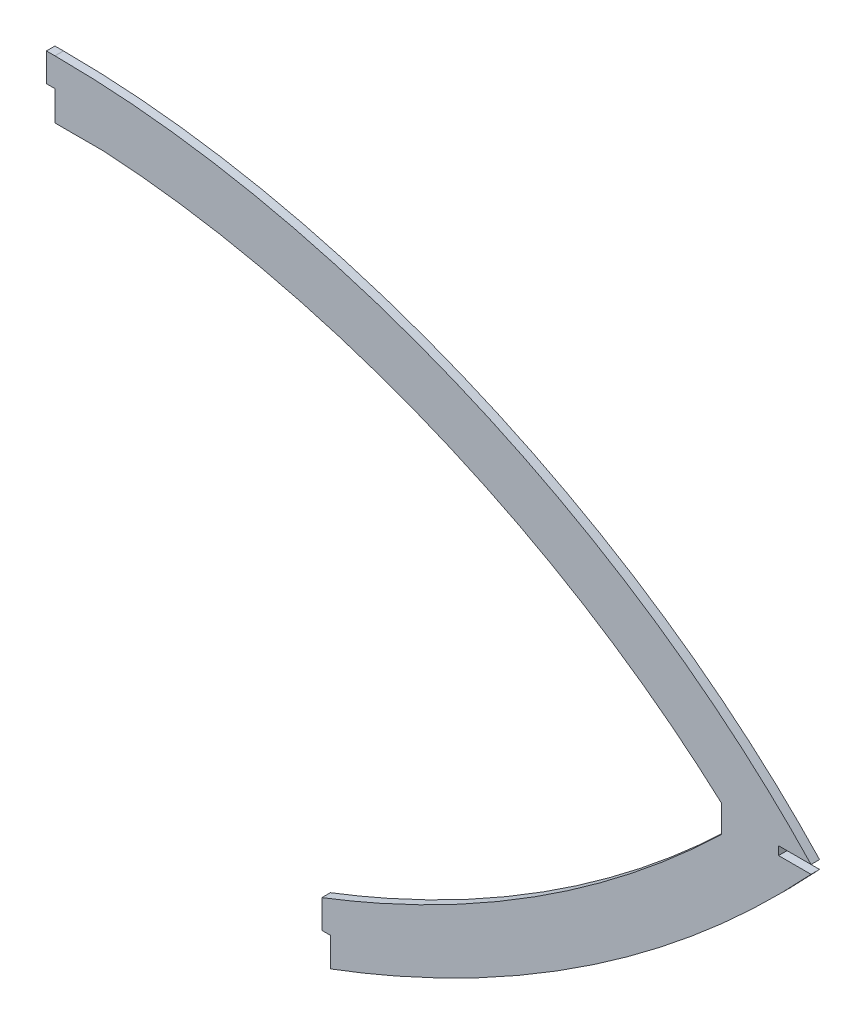
ISO-10303-21;
HEADER;
FILE_DESCRIPTION(('STEP AP214'),'2;1');
FILE_NAME('part.step','',(''),(''),'','','');
FILE_SCHEMA(('AUTOMOTIVE_DESIGN { 1 0 10303 214 1 1 1 1 }'));
ENDSEC;
DATA;
#1=APPLICATION_CONTEXT('core data for automotive mechanical design processes');
#2=APPLICATION_PROTOCOL_DEFINITION('international standard','automotive_design',2000,#1);
#3=PRODUCT_CONTEXT('',#1,'mechanical');
#4=PRODUCT('Part','Part','',(#3));
#5=PRODUCT_RELATED_PRODUCT_CATEGORY('part','',(#4));
#6=PRODUCT_DEFINITION_FORMATION('','',#4);
#7=PRODUCT_DEFINITION_CONTEXT('part definition',#1,'design');
#8=PRODUCT_DEFINITION('design','',#6,#7);
#9=PRODUCT_DEFINITION_SHAPE('','',#8);
#10=(LENGTH_UNIT() NAMED_UNIT(*) SI_UNIT(.MILLI.,.METRE.));
#11=(NAMED_UNIT(*) PLANE_ANGLE_UNIT() SI_UNIT($,.RADIAN.));
#12=(NAMED_UNIT(*) SI_UNIT($,.STERADIAN.) SOLID_ANGLE_UNIT());
#13=UNCERTAINTY_MEASURE_WITH_UNIT(LENGTH_MEASURE(1.E-05),#10,'distance_accuracy_value','');
#14=(GEOMETRIC_REPRESENTATION_CONTEXT(3) GLOBAL_UNCERTAINTY_ASSIGNED_CONTEXT((#13)) GLOBAL_UNIT_ASSIGNED_CONTEXT((#10,
#11,#12)) REPRESENTATION_CONTEXT('',''));
#15=CARTESIAN_POINT('',(0.,0.,0.));
#16=DIRECTION('',(0.,0.,1.));
#17=DIRECTION('',(1.,0.,0.));
#18=AXIS2_PLACEMENT_3D('',#15,#16,#17);
#19=CARTESIAN_POINT('',(179.035361639188,140.021619694715,1.5));
#20=CARTESIAN_POINT('',(181.451777580241,139.887166151419,1.5));
#21=CARTESIAN_POINT('',(186.271210948016,139.563639144262,1.5));
#22=CARTESIAN_POINT('',(195.976712464811,138.69264853337,1.5));
#23=CARTESIAN_POINT('',(208.159899275489,137.19054970122,1.5));
#24=CARTESIAN_POINT('',(222.833276173163,134.736731875585,1.5));
#25=CARTESIAN_POINT('',(242.399897845226,130.612978325226,1.5));
#26=CARTESIAN_POINT('',(266.74766433823,123.892143887001,1.5));
#27=CARTESIAN_POINT('',(295.413182721145,113.431330714995,1.5));
#28=CARTESIAN_POINT('',(323.156642219578,100.694908753297,1.5));
#29=CARTESIAN_POINT('',(345.202971848323,88.2922810069508,1.5));
#30=CARTESIAN_POINT('',(362.016251386222,77.3660350543902,1.5));
#31=CARTESIAN_POINT('',(374.171038921248,68.686714488743,1.5));
#32=CARTESIAN_POINT('',(383.882043125367,61.0676553194488,1.5));
#33=CARTESIAN_POINT('',(391.384292246197,54.7450596330478,1.5));
#34=CARTESIAN_POINT('',(395.033685800336,51.5180859217659,1.5));
#35=CARTESIAN_POINT('',(396.841652361278,49.8799132458824,1.5));
#36=B_SPLINE_CURVE_WITH_KNOTS('',3,(#19,#20,#21,#22,#23,#24,#25,#26,#27,#28,#29,#30,#31,#32,#33,
#34,#35),.UNSPECIFIED.,.F.,.F.,(4,1,1,1,1,1,1,1,1,1,1,1,1,1,4),(0.0626053330073355,
0.0889888209647748,0.115372308922214,0.168139284837093,0.220906260751971,0.27367323666685,
0.379207188496607,0.484741140326364,0.590275092156121,0.695809043985878,0.748576019900757,
0.801342995815636,0.854109971730514,0.880493459687953,0.906876947645393),.UNSPECIFIED.);
#37=DIRECTION('',(0.,0.,-1.));
#38=VECTOR('',#37,1.);
#39=SURFACE_OF_LINEAR_EXTRUSION('',#36,#38);
#40=CARTESIAN_POINT('',(179.035361639188,140.021619694715,-1.5));
#41=CARTESIAN_POINT('',(181.451777580241,139.887166151419,-1.5));
#42=CARTESIAN_POINT('',(186.271210948016,139.563639144262,-1.5));
#43=CARTESIAN_POINT('',(195.976712464811,138.69264853337,-1.5));
#44=CARTESIAN_POINT('',(208.159899275489,137.19054970122,-1.5));
#45=CARTESIAN_POINT('',(222.833276173163,134.736731875585,-1.5));
#46=CARTESIAN_POINT('',(242.399897845226,130.612978325226,-1.5));
#47=CARTESIAN_POINT('',(266.74766433823,123.892143887001,-1.5));
#48=CARTESIAN_POINT('',(295.413182721145,113.431330714995,-1.5));
#49=CARTESIAN_POINT('',(323.156642219578,100.694908753297,-1.5));
#50=CARTESIAN_POINT('',(345.202971848323,88.2922810069508,-1.5));
#51=CARTESIAN_POINT('',(362.016251386222,77.3660350543902,-1.5));
#52=CARTESIAN_POINT('',(374.171038921248,68.686714488743,-1.5));
#53=CARTESIAN_POINT('',(383.882043125367,61.0676553194488,-1.5));
#54=CARTESIAN_POINT('',(391.384292246197,54.7450596330478,-1.5));
#55=CARTESIAN_POINT('',(395.033685800336,51.5180859217659,-1.5));
#56=CARTESIAN_POINT('',(396.841652361278,49.8799132458824,-1.5));
#57=B_SPLINE_CURVE_WITH_KNOTS('',3,(#40,#41,#42,#43,#44,#45,#46,#47,#48,#49,#50,#51,#52,#53,#54,
#55,#56),.UNSPECIFIED.,.F.,.F.,(4,1,1,1,1,1,1,1,1,1,1,1,1,1,4),(0.0626053330073355,
0.0889888209647748,0.115372308922214,0.168139284837093,0.220906260751971,0.27367323666685,
0.379207188496607,0.484741140326364,0.590275092156121,0.695809043985878,0.748576019900757,
0.801342995815636,0.854109971730514,0.880493459687953,0.906876947645393),.UNSPECIFIED.);
#58=CARTESIAN_POINT('',(179.035361639188,140.021619694715,-1.5));
#59=VERTEX_POINT('',#58);
#60=CARTESIAN_POINT('',(396.841652361276,49.8799132458821,-1.5));
#61=VERTEX_POINT('',#60);
#62=EDGE_CURVE('E179',#59,#61,#57,.T.);
#63=ORIENTED_EDGE('',*,*,#62,.T.);
#64=DIRECTION('',(0.,0.,-1.));
#65=VECTOR('',#64,1.);
#66=CARTESIAN_POINT('',(396.841652361276,49.8799132458821,1.5));
#67=LINE('',#66,#65);
#68=CARTESIAN_POINT('',(396.841652361276,49.8799132458821,1.5));
#69=VERTEX_POINT('',#68);
#70=EDGE_CURVE('E11',#69,#61,#67,.T.);
#71=ORIENTED_EDGE('',*,*,#70,.F.);
#72=CARTESIAN_POINT('',(179.035361639188,140.021619694715,1.5));
#73=VERTEX_POINT('',#72);
#74=EDGE_CURVE('E240',#73,#69,#36,.T.);
#75=ORIENTED_EDGE('',*,*,#74,.F.);
#76=DIRECTION('',(0.,0.,-1.));
#77=VECTOR('',#76,1.);
#78=CARTESIAN_POINT('',(179.035361639188,140.021619694715,1.5));
#79=LINE('',#78,#77);
#80=EDGE_CURVE('E50',#73,#59,#79,.T.);
#81=ORIENTED_EDGE('',*,*,#80,.T.);
#82=EDGE_LOOP('',(#63,#71,#75,#81));
#83=FACE_BOUND('',#82,.T.);
#84=ADVANCED_FACE('F33',(#83),#39,.F.);
#85=CARTESIAN_POINT('',(396.841652361276,49.8799132458821,1.5));
#86=DIRECTION('',(1.,0.,0.));
#87=DIRECTION('',(0.,1.,0.));
#88=AXIS2_PLACEMENT_3D('',#85,#86,#87);
#89=PLANE('',#88);
#90=DIRECTION('',(0.,-1.,0.));
#91=VECTOR('',#90,1.);
#92=CARTESIAN_POINT('',(396.841652361276,49.8799132458821,-1.5));
#93=LINE('',#92,#91);
#94=CARTESIAN_POINT('',(396.841652361282,40.4727705687721,-1.5));
#95=VERTEX_POINT('',#94);
#96=EDGE_CURVE('E183',#61,#95,#93,.T.);
#97=ORIENTED_EDGE('',*,*,#96,.T.);
#98=DIRECTION('',(0.,0.,-1.));
#99=VECTOR('',#98,1.);
#100=CARTESIAN_POINT('',(396.841652361282,40.4727705687721,1.5));
#101=LINE('',#100,#99);
#102=CARTESIAN_POINT('',(396.841652361282,40.4727705687721,1.5));
#103=VERTEX_POINT('',#102);
#104=EDGE_CURVE('E42',#103,#95,#101,.T.);
#105=ORIENTED_EDGE('',*,*,#104,.F.);
#106=DIRECTION('',(0.,-1.,0.));
#107=VECTOR('',#106,1.);
#108=CARTESIAN_POINT('',(396.841652361276,49.8799132458821,1.5));
#109=LINE('',#108,#107);
#110=EDGE_CURVE('E112',#69,#103,#109,.T.);
#111=ORIENTED_EDGE('',*,*,#110,.F.);
#112=ORIENTED_EDGE('',*,*,#70,.T.);
#113=EDGE_LOOP('',(#97,#105,#111,#112));
#114=FACE_BOUND('',#113,.T.);
#115=ADVANCED_FACE('F324',(#114),#89,.F.);
#116=CARTESIAN_POINT('',(396.841652361282,40.4727705687721,1.5));
#117=CARTESIAN_POINT('',(394.239004179472,37.9595999150632,1.5));
#118=CARTESIAN_POINT('',(388.961439177249,32.9902478171584,1.5));
#119=CARTESIAN_POINT('',(378.229523893908,23.3873633959179,1.5));
#120=CARTESIAN_POINT('',(364.429917553594,11.9611039488446,1.5));
#121=CARTESIAN_POINT('',(347.26607210347,-0.817297143373489,1.5));
#122=CARTESIAN_POINT('',(329.487511137407,-12.6723853772835,1.5));
#123=CARTESIAN_POINT('',(311.087861831125,-23.6078713707903,1.5));
#124=CARTESIAN_POINT('',(292.061212903877,-33.6267754257668,1.5));
#125=CARTESIAN_POINT('',(275.670529756605,-41.2161175694856,1.5));
#126=CARTESIAN_POINT('',(262.246840767912,-46.8269953530709,1.5));
#127=CARTESIAN_POINT('',(255.407149342618,-49.487699314822,1.5));
#128=CARTESIAN_POINT('',(251.979122090113,-50.7728830772801,1.5));
#129=B_SPLINE_CURVE_WITH_KNOTS('',3,(#116,#117,#118,#119,#120,#121,#122,#123,#124,#125,#126,
#127,#128),.UNSPECIFIED.,.F.,.F.,(4,1,1,1,1,1,1,1,1,1,4),(0.498678357608575,0.498869026669873,
0.499059695731171,0.499441033853768,0.499822371976365,0.500203710098962,0.500585048221559,
0.500966386344155,0.501347724466752,0.501538393528051,0.501729062589349),.UNSPECIFIED.);
#130=DIRECTION('',(0.,0.,-1.));
#131=VECTOR('',#130,1.);
#132=SURFACE_OF_LINEAR_EXTRUSION('',#129,#131);
#133=CARTESIAN_POINT('',(396.841652361282,40.4727705687721,-1.5));
#134=CARTESIAN_POINT('',(394.239004179472,37.9595999150632,-1.5));
#135=CARTESIAN_POINT('',(388.961439177249,32.9902478171584,-1.5));
#136=CARTESIAN_POINT('',(378.229523893908,23.3873633959179,-1.5));
#137=CARTESIAN_POINT('',(364.429917553594,11.9611039488446,-1.5));
#138=CARTESIAN_POINT('',(347.26607210347,-0.817297143373489,-1.5));
#139=CARTESIAN_POINT('',(329.487511137407,-12.6723853772835,-1.5));
#140=CARTESIAN_POINT('',(311.087861831125,-23.6078713707903,-1.5));
#141=CARTESIAN_POINT('',(292.061212903877,-33.6267754257668,-1.5));
#142=CARTESIAN_POINT('',(275.670529756605,-41.2161175694856,-1.5));
#143=CARTESIAN_POINT('',(262.246840767912,-46.8269953530709,-1.5));
#144=CARTESIAN_POINT('',(255.407149342618,-49.487699314822,-1.5));
#145=CARTESIAN_POINT('',(251.979122090113,-50.7728830772801,-1.5));
#146=B_SPLINE_CURVE_WITH_KNOTS('',3,(#133,#134,#135,#136,#137,#138,#139,#140,#141,#142,#143,
#144,#145),.UNSPECIFIED.,.F.,.F.,(4,1,1,1,1,1,1,1,1,1,4),(0.498678357608575,0.498869026669873,
0.499059695731171,0.499441033853768,0.499822371976365,0.500203710098962,0.500585048221559,
0.500966386344155,0.501347724466752,0.501538393528051,0.501729062589349),.UNSPECIFIED.);
#147=CARTESIAN_POINT('',(255.99999988193,-49.2432631441999,-1.5));
#148=VERTEX_POINT('',#147);
#149=EDGE_CURVE('E188',#95,#148,#146,.T.);
#150=ORIENTED_EDGE('',*,*,#149,.T.);
#151=DIRECTION('',(0.,0.,-1.));
#152=VECTOR('',#151,1.);
#153=CARTESIAN_POINT('',(255.99999988193,-49.2432631441999,1.5));
#154=LINE('',#153,#152);
#155=CARTESIAN_POINT('',(255.99999988193,-49.2432631441999,1.5));
#156=VERTEX_POINT('',#155);
#157=EDGE_CURVE('E263',#156,#148,#154,.T.);
#158=ORIENTED_EDGE('',*,*,#157,.F.);
#159=EDGE_CURVE('E270',#103,#156,#129,.T.);
#160=ORIENTED_EDGE('',*,*,#159,.F.);
#161=ORIENTED_EDGE('',*,*,#104,.T.);
#162=EDGE_LOOP('',(#150,#158,#160,#161));
#163=FACE_BOUND('',#162,.T.);
#164=ADVANCED_FACE('F268',(#163),#132,.F.);
#165=CARTESIAN_POINT('',(256.000000000003,-59.243263103591,1.5));
#166=DIRECTION('',(-1.,-1.18072552215273E-08,0.));
#167=DIRECTION('',(1.18072552215273E-08,-1.,0.));
#168=AXIS2_PLACEMENT_3D('',#165,#166,#167);
#169=PLANE('',#168);
#170=DIRECTION('',(-1.18072552215273E-08,1.,0.));
#171=VECTOR('',#170,1.);
#172=CARTESIAN_POINT('',(256.000000000003,-59.243263103591,-1.5));
#173=LINE('',#172,#171);
#174=CARTESIAN_POINT('',(256.000000000003,-59.243263103591,-1.5));
#175=VERTEX_POINT('',#174);
#176=EDGE_CURVE('E193',#175,#148,#173,.T.);
#177=ORIENTED_EDGE('',*,*,#176,.F.);
#178=DIRECTION('',(0.,0.,-1.));
#179=VECTOR('',#178,1.);
#180=CARTESIAN_POINT('',(256.000000000003,-59.243263103591,1.5));
#181=LINE('',#180,#179);
#182=CARTESIAN_POINT('',(256.000000000003,-59.243263103591,1.5));
#183=VERTEX_POINT('',#182);
#184=EDGE_CURVE('E261',#183,#175,#181,.T.);
#185=ORIENTED_EDGE('',*,*,#184,.F.);
#186=DIRECTION('',(-1.18072552215273E-08,1.,0.));
#187=VECTOR('',#186,1.);
#188=CARTESIAN_POINT('',(256.000000000003,-59.243263103591,1.5));
#189=LINE('',#188,#187);
#190=EDGE_CURVE('E279',#183,#156,#189,.T.);
#191=ORIENTED_EDGE('',*,*,#190,.T.);
#192=ORIENTED_EDGE('',*,*,#157,.T.);
#193=EDGE_LOOP('',(#177,#185,#191,#192));
#194=FACE_BOUND('',#193,.T.);
#195=ADVANCED_FACE('F276',(#194),#169,.T.);
#196=CARTESIAN_POINT('',(259.000000000003,-59.243263103591,1.5));
#197=DIRECTION('',(0.,-1.,0.));
#198=DIRECTION('',(0.,0.,-1.));
#199=AXIS2_PLACEMENT_3D('',#196,#197,#198);
#200=PLANE('',#199);
#201=DIRECTION('',(-1.,0.,0.));
#202=VECTOR('',#201,1.);
#203=CARTESIAN_POINT('',(259.000000000003,-59.243263103591,-1.5));
#204=LINE('',#203,#202);
#205=CARTESIAN_POINT('',(259.000000000003,-59.243263103591,-1.5));
#206=VERTEX_POINT('',#205);
#207=EDGE_CURVE('E199',#206,#175,#204,.T.);
#208=ORIENTED_EDGE('',*,*,#207,.F.);
#209=DIRECTION('',(0.,0.,-1.));
#210=VECTOR('',#209,1.);
#211=CARTESIAN_POINT('',(259.000000000003,-59.243263103591,1.5));
#212=LINE('',#211,#210);
#213=CARTESIAN_POINT('',(259.000000000003,-59.243263103591,1.5));
#214=VERTEX_POINT('',#213);
#215=EDGE_CURVE('E259',#214,#206,#212,.T.);
#216=ORIENTED_EDGE('',*,*,#215,.F.);
#217=DIRECTION('',(-1.,0.,0.));
#218=VECTOR('',#217,1.);
#219=CARTESIAN_POINT('',(259.000000000003,-59.243263103591,1.5));
#220=LINE('',#219,#218);
#221=EDGE_CURVE('E282',#214,#183,#220,.T.);
#222=ORIENTED_EDGE('',*,*,#221,.T.);
#223=ORIENTED_EDGE('',*,*,#184,.T.);
#224=EDGE_LOOP('',(#208,#216,#222,#223));
#225=FACE_BOUND('',#224,.T.);
#226=ADVANCED_FACE('F316',(#225),#200,.T.);
#227=CARTESIAN_POINT('',(259.000000000003,-69.4999999999995,1.5));
#228=DIRECTION('',(-1.,0.,0.));
#229=DIRECTION('',(0.,-1.,0.));
#230=AXIS2_PLACEMENT_3D('',#227,#228,#229);
#231=PLANE('',#230);
#232=DIRECTION('',(0.,1.,0.));
#233=VECTOR('',#232,1.);
#234=CARTESIAN_POINT('',(259.000000000003,-69.4999999999995,-1.5));
#235=LINE('',#234,#233);
#236=CARTESIAN_POINT('',(259.000000181959,-69.4999999318329,-1.5));
#237=VERTEX_POINT('',#236);
#238=EDGE_CURVE('E202',#237,#206,#235,.T.);
#239=ORIENTED_EDGE('',*,*,#238,.F.);
#240=DIRECTION('',(0.,0.,-1.));
#241=VECTOR('',#240,1.);
#242=CARTESIAN_POINT('',(259.000000181959,-69.4999999318329,1.5));
#243=LINE('',#242,#241);
#244=CARTESIAN_POINT('',(259.000000181959,-69.4999999318329,1.5));
#245=VERTEX_POINT('',#244);
#246=EDGE_CURVE('E257',#245,#237,#243,.T.);
#247=ORIENTED_EDGE('',*,*,#246,.F.);
#248=DIRECTION('',(0.,1.,0.));
#249=VECTOR('',#248,1.);
#250=CARTESIAN_POINT('',(259.000000000003,-69.4999999999995,1.5));
#251=LINE('',#250,#249);
#252=EDGE_CURVE('E284',#245,#214,#251,.T.);
#253=ORIENTED_EDGE('',*,*,#252,.T.);
#254=ORIENTED_EDGE('',*,*,#215,.T.);
#255=EDGE_LOOP('',(#239,#247,#253,#254));
#256=FACE_BOUND('',#255,.T.);
#257=ADVANCED_FACE('F311',(#256),#231,.T.);
#258=CARTESIAN_POINT('',(-531495.738377634,847327.796993992,1.5));
#259=CARTESIAN_POINT('',(556611.37032446,-831030.370173658,1.5));
#260=CARTESIAN_POINT('',(-580326.666853682,814641.260779461,1.5));
#261=B_SPLINE_CURVE_WITH_KNOTS('',2,(#258,#259,#260),.UNSPECIFIED.,.F.,.F.,(3,3),(0.,1.),.UNSPECIFIED.);
#262=DIRECTION('',(0.,0.,-1.));
#263=VECTOR('',#262,1.);
#264=SURFACE_OF_LINEAR_EXTRUSION('',#261,#263);
#265=CARTESIAN_POINT('',(-531495.738377634,847327.796993992,-1.5));
#266=CARTESIAN_POINT('',(556611.37032446,-831030.370173658,-1.5));
#267=CARTESIAN_POINT('',(-580326.666853682,814641.260779461,-1.5));
#268=B_SPLINE_CURVE_WITH_KNOTS('',2,(#265,#266,#267),.UNSPECIFIED.,.F.,.F.,(3,3),(0.,1.),.UNSPECIFIED.);
#269=CARTESIAN_POINT('',(428.2966311298,43.9999999996248,-1.5));
#270=VERTEX_POINT('',#269);
#271=EDGE_CURVE('E205',#270,#237,#268,.T.);
#272=ORIENTED_EDGE('',*,*,#271,.F.);
#273=DIRECTION('',(0.,0.,-1.));
#274=VECTOR('',#273,1.);
#275=CARTESIAN_POINT('',(428.2966311298,43.9999999996248,1.5));
#276=LINE('',#275,#274);
#277=CARTESIAN_POINT('',(428.2966311298,43.9999999996248,1.5));
#278=VERTEX_POINT('',#277);
#279=EDGE_CURVE('E255',#278,#270,#276,.T.);
#280=ORIENTED_EDGE('',*,*,#279,.F.);
#281=EDGE_CURVE('E294',#278,#245,#261,.T.);
#282=ORIENTED_EDGE('',*,*,#281,.T.);
#283=ORIENTED_EDGE('',*,*,#246,.T.);
#284=EDGE_LOOP('',(#272,#280,#282,#283));
#285=FACE_BOUND('',#284,.T.);
#286=ADVANCED_FACE('F306',(#285),#264,.T.);
#287=CARTESIAN_POINT('',(416.841652361276,43.9999999999978,1.5));
#288=DIRECTION('',(3.25653101426148E-11,1.,0.));
#289=DIRECTION('',(-1.,3.25653101426148E-11,0.));
#290=AXIS2_PLACEMENT_3D('',#287,#288,#289);
#291=PLANE('',#290);
#292=DIRECTION('',(1.,-3.25653101426148E-11,0.));
#293=VECTOR('',#292,1.);
#294=CARTESIAN_POINT('',(416.841652361276,43.9999999999978,-1.5));
#295=LINE('',#294,#293);
#296=CARTESIAN_POINT('',(416.841652361276,43.9999999999978,-1.5));
#297=VERTEX_POINT('',#296);
#298=EDGE_CURVE('E210',#297,#270,#295,.T.);
#299=ORIENTED_EDGE('',*,*,#298,.F.);
#300=DIRECTION('',(0.,0.,-1.));
#301=VECTOR('',#300,1.);
#302=CARTESIAN_POINT('',(416.841652361276,43.9999999999978,1.5));
#303=LINE('',#302,#301);
#304=CARTESIAN_POINT('',(416.841652361276,43.9999999999978,1.5));
#305=VERTEX_POINT('',#304);
#306=EDGE_CURVE('E253',#305,#297,#303,.T.);
#307=ORIENTED_EDGE('',*,*,#306,.F.);
#308=DIRECTION('',(1.,-3.25653101426148E-11,0.));
#309=VECTOR('',#308,1.);
#310=CARTESIAN_POINT('',(416.841652361276,43.9999999999978,1.5));
#311=LINE('',#310,#309);
#312=EDGE_CURVE('E300',#305,#278,#311,.T.);
#313=ORIENTED_EDGE('',*,*,#312,.T.);
#314=ORIENTED_EDGE('',*,*,#279,.T.);
#315=EDGE_LOOP('',(#299,#307,#313,#314));
#316=FACE_BOUND('',#315,.T.);
#317=ADVANCED_FACE('F310',(#316),#291,.T.);
#318=CARTESIAN_POINT('',(416.841652361276,46.9999999999978,1.5));
#319=DIRECTION('',(1.,0.,0.));
#320=DIRECTION('',(0.,0.,-1.));
#321=AXIS2_PLACEMENT_3D('',#318,#319,#320);
#322=PLANE('',#321);
#323=DIRECTION('',(0.,-1.,0.));
#324=VECTOR('',#323,1.);
#325=CARTESIAN_POINT('',(416.841652361276,46.9999999999978,-1.5));
#326=LINE('',#325,#324);
#327=CARTESIAN_POINT('',(416.841652361276,46.9999999999978,-1.5));
#328=VERTEX_POINT('',#327);
#329=EDGE_CURVE('E216',#328,#297,#326,.T.);
#330=ORIENTED_EDGE('',*,*,#329,.F.);
#331=DIRECTION('',(0.,0.,-1.));
#332=VECTOR('',#331,1.);
#333=CARTESIAN_POINT('',(416.841652361276,46.9999999999978,1.5));
#334=LINE('',#333,#332);
#335=CARTESIAN_POINT('',(416.841652361276,46.9999999999978,1.5));
#336=VERTEX_POINT('',#335);
#337=EDGE_CURVE('E251',#336,#328,#334,.T.);
#338=ORIENTED_EDGE('',*,*,#337,.F.);
#339=DIRECTION('',(0.,-1.,0.));
#340=VECTOR('',#339,1.);
#341=CARTESIAN_POINT('',(416.841652361276,46.9999999999978,1.5));
#342=LINE('',#341,#340);
#343=EDGE_CURVE('E385',#336,#305,#342,.T.);
#344=ORIENTED_EDGE('',*,*,#343,.T.);
#345=ORIENTED_EDGE('',*,*,#306,.T.);
#346=EDGE_LOOP('',(#330,#338,#344,#345));
#347=FACE_BOUND('',#346,.T.);
#348=ADVANCED_FACE('F382',(#347),#322,.T.);
#349=CARTESIAN_POINT('',(428.287791794617,47.0000000026394,1.5));
#350=DIRECTION('',(2.30779974338638E-10,-1.,0.));
#351=DIRECTION('',(1.,2.30779974338638E-10,0.));
#352=AXIS2_PLACEMENT_3D('',#349,#350,#351);
#353=PLANE('',#352);
#354=DIRECTION('',(-1.,-2.30779974338638E-10,0.));
#355=VECTOR('',#354,1.);
#356=CARTESIAN_POINT('',(428.287791794617,47.0000000026394,-1.5));
#357=LINE('',#356,#355);
#358=CARTESIAN_POINT('',(428.287791794618,47.000000002641,-1.5));
#359=VERTEX_POINT('',#358);
#360=EDGE_CURVE('E219',#359,#328,#357,.T.);
#361=ORIENTED_EDGE('',*,*,#360,.F.);
#362=DIRECTION('',(0.,0.,-1.));
#363=VECTOR('',#362,1.);
#364=CARTESIAN_POINT('',(428.287791794618,47.000000002641,1.5));
#365=LINE('',#364,#363);
#366=CARTESIAN_POINT('',(428.287791794618,47.000000002641,1.5));
#367=VERTEX_POINT('',#366);
#368=EDGE_CURVE('E249',#367,#359,#365,.T.);
#369=ORIENTED_EDGE('',*,*,#368,.F.);
#370=DIRECTION('',(-1.,-2.30779974338638E-10,0.));
#371=VECTOR('',#370,1.);
#372=CARTESIAN_POINT('',(428.287791794617,47.0000000026394,1.5));
#373=LINE('',#372,#371);
#374=EDGE_CURVE('E365',#367,#336,#373,.T.);
#375=ORIENTED_EDGE('',*,*,#374,.T.);
#376=ORIENTED_EDGE('',*,*,#337,.T.);
#377=EDGE_LOOP('',(#361,#369,#375,#376));
#378=FACE_BOUND('',#377,.T.);
#379=ADVANCED_FACE('F355',(#378),#353,.T.);
#380=CARTESIAN_POINT('',(162.000000000001,160.5,1.5));
#381=CARTESIAN_POINT('',(257.407389322356,160.5,1.5));
#382=CARTESIAN_POINT('',(362.269693390266,117.467207350968,1.5));
#383=CARTESIAN_POINT('',(428.287791794618,47.000000002641,1.5));
#384=B_SPLINE_CURVE_WITH_KNOTS('',3,(#380,#381,#382,#383),.UNSPECIFIED.,.F.,.F.,(4,4),(0.,
0.992973686677581),.UNSPECIFIED.);
#385=DIRECTION('',(0.,0.,-1.));
#386=VECTOR('',#385,1.);
#387=SURFACE_OF_LINEAR_EXTRUSION('',#384,#386);
#388=CARTESIAN_POINT('',(162.000000000001,160.5,-1.5));
#389=CARTESIAN_POINT('',(257.407389322356,160.5,-1.5));
#390=CARTESIAN_POINT('',(362.269693390266,117.467207350968,-1.5));
#391=CARTESIAN_POINT('',(428.287791794618,47.000000002641,-1.5));
#392=B_SPLINE_CURVE_WITH_KNOTS('',3,(#388,#389,#390,#391),.UNSPECIFIED.,.F.,.F.,(4,4),(0.,
0.992973686677581),.UNSPECIFIED.);
#393=CARTESIAN_POINT('',(162.000000000001,160.5,-1.5));
#394=VERTEX_POINT('',#393);
#395=EDGE_CURVE('E222',#394,#359,#392,.T.);
#396=ORIENTED_EDGE('',*,*,#395,.F.);
#397=DIRECTION('',(0.,0.,-1.));
#398=VECTOR('',#397,1.);
#399=CARTESIAN_POINT('',(162.000000000001,160.5,1.5));
#400=LINE('',#399,#398);
#401=CARTESIAN_POINT('',(162.000000000001,160.5,1.5));
#402=VERTEX_POINT('',#401);
#403=EDGE_CURVE('E247',#402,#394,#400,.T.);
#404=ORIENTED_EDGE('',*,*,#403,.F.);
#405=EDGE_CURVE('E357',#402,#367,#384,.T.);
#406=ORIENTED_EDGE('',*,*,#405,.T.);
#407=ORIENTED_EDGE('',*,*,#368,.T.);
#408=EDGE_LOOP('',(#396,#404,#406,#407));
#409=FACE_BOUND('',#408,.T.);
#410=ADVANCED_FACE('F350',(#409),#387,.T.);
#411=CARTESIAN_POINT('',(162.000000000001,160.5,1.5));
#412=DIRECTION('',(5.27355936696963E-13,-1.,0.));
#413=DIRECTION('',(1.,5.27355936696963E-13,0.));
#414=AXIS2_PLACEMENT_3D('',#411,#412,#413);
#415=PLANE('',#414);
#416=DIRECTION('',(-1.,-5.27355936696963E-13,0.));
#417=VECTOR('',#416,1.);
#418=CARTESIAN_POINT('',(162.000000000001,160.5,-1.5));
#419=LINE('',#418,#417);
#420=CARTESIAN_POINT('',(159.000000000001,160.499999999998,-1.5));
#421=VERTEX_POINT('',#420);
#422=EDGE_CURVE('E227',#394,#421,#419,.T.);
#423=ORIENTED_EDGE('',*,*,#422,.T.);
#424=DIRECTION('',(0.,0.,-1.));
#425=VECTOR('',#424,1.);
#426=CARTESIAN_POINT('',(159.000000000001,160.499999999998,1.5));
#427=LINE('',#426,#425);
#428=CARTESIAN_POINT('',(159.000000000001,160.499999999998,1.5));
#429=VERTEX_POINT('',#428);
#430=EDGE_CURVE('E244',#429,#421,#427,.T.);
#431=ORIENTED_EDGE('',*,*,#430,.F.);
#432=DIRECTION('',(-1.,-5.27355936696963E-13,0.));
#433=VECTOR('',#432,1.);
#434=CARTESIAN_POINT('',(162.000000000001,160.5,1.5));
#435=LINE('',#434,#433);
#436=EDGE_CURVE('E364',#402,#429,#435,.T.);
#437=ORIENTED_EDGE('',*,*,#436,.F.);
#438=ORIENTED_EDGE('',*,*,#403,.T.);
#439=EDGE_LOOP('',(#423,#431,#437,#438));
#440=FACE_BOUND('',#439,.T.);
#441=ADVANCED_FACE('F346',(#440),#415,.F.);
#442=CARTESIAN_POINT('',(159.000000000001,160.499999999998,1.5));
#443=DIRECTION('',(1.,0.,0.));
#444=DIRECTION('',(0.,0.,-1.));
#445=AXIS2_PLACEMENT_3D('',#442,#443,#444);
#446=PLANE('',#445);
#447=DIRECTION('',(0.,-1.,0.));
#448=VECTOR('',#447,1.);
#449=CARTESIAN_POINT('',(159.000000000001,160.499999999998,-1.5));
#450=LINE('',#449,#448);
#451=CARTESIAN_POINT('',(159.000000000001,150.499999999998,-1.5));
#452=VERTEX_POINT('',#451);
#453=EDGE_CURVE('E232',#421,#452,#450,.T.);
#454=ORIENTED_EDGE('',*,*,#453,.T.);
#455=DIRECTION('',(0.,0.,-1.));
#456=VECTOR('',#455,1.);
#457=CARTESIAN_POINT('',(159.000000000001,150.499999999998,1.5));
#458=LINE('',#457,#456);
#459=CARTESIAN_POINT('',(159.000000000001,150.499999999998,1.5));
#460=VERTEX_POINT('',#459);
#461=EDGE_CURVE('E171',#460,#452,#458,.T.);
#462=ORIENTED_EDGE('',*,*,#461,.F.);
#463=DIRECTION('',(0.,-1.,0.));
#464=VECTOR('',#463,1.);
#465=CARTESIAN_POINT('',(159.000000000001,160.499999999998,1.5));
#466=LINE('',#465,#464);
#467=EDGE_CURVE('E159',#429,#460,#466,.T.);
#468=ORIENTED_EDGE('',*,*,#467,.F.);
#469=ORIENTED_EDGE('',*,*,#430,.T.);
#470=EDGE_LOOP('',(#454,#462,#468,#469));
#471=FACE_BOUND('',#470,.T.);
#472=ADVANCED_FACE('F343',(#471),#446,.F.);
#473=CARTESIAN_POINT('',(159.000000000001,150.499999999998,1.5));
#474=DIRECTION('',(-6.29126380620951E-13,1.,0.));
#475=DIRECTION('',(-1.,-6.29126380620951E-13,0.));
#476=AXIS2_PLACEMENT_3D('',#473,#474,#475);
#477=PLANE('',#476);
#478=DIRECTION('',(1.,6.29126380620951E-13,0.));
#479=VECTOR('',#478,1.);
#480=CARTESIAN_POINT('',(159.000000000001,150.499999999998,-1.5));
#481=LINE('',#480,#479);
#482=CARTESIAN_POINT('',(162.000000000001,150.5,-1.5));
#483=VERTEX_POINT('',#482);
#484=EDGE_CURVE('E168',#452,#483,#481,.T.);
#485=ORIENTED_EDGE('',*,*,#484,.T.);
#486=DIRECTION('',(0.,0.,-1.));
#487=VECTOR('',#486,1.);
#488=CARTESIAN_POINT('',(162.000000000001,150.5,1.5));
#489=LINE('',#488,#487);
#490=CARTESIAN_POINT('',(162.000000000001,150.5,1.5));
#491=VERTEX_POINT('',#490);
#492=EDGE_CURVE('E165',#491,#483,#489,.T.);
#493=ORIENTED_EDGE('',*,*,#492,.F.);
#494=DIRECTION('',(1.,6.29126380620951E-13,0.));
#495=VECTOR('',#494,1.);
#496=CARTESIAN_POINT('',(159.000000000001,150.499999999998,1.5));
#497=LINE('',#496,#495);
#498=EDGE_CURVE('E152',#460,#491,#497,.T.);
#499=ORIENTED_EDGE('',*,*,#498,.F.);
#500=ORIENTED_EDGE('',*,*,#461,.T.);
#501=EDGE_LOOP('',(#485,#493,#499,#500));
#502=FACE_BOUND('',#501,.T.);
#503=ADVANCED_FACE('F166',(#502),#477,.F.);
#504=CARTESIAN_POINT('',(162.000000000001,140.021619694714,1.5));
#505=DIRECTION('',(-1.,0.,0.));
#506=DIRECTION('',(0.,0.,1.));
#507=AXIS2_PLACEMENT_3D('',#504,#505,#506);
#508=PLANE('',#507);
#509=DIRECTION('',(0.,1.,0.));
#510=VECTOR('',#509,1.);
#511=CARTESIAN_POINT('',(162.000000000001,140.021619694714,-1.5));
#512=LINE('',#511,#510);
#513=CARTESIAN_POINT('',(162.000000000001,140.021619694714,-1.5));
#514=VERTEX_POINT('',#513);
#515=EDGE_CURVE('E235',#514,#483,#512,.T.);
#516=ORIENTED_EDGE('',*,*,#515,.F.);
#517=DIRECTION('',(0.,0.,-1.));
#518=VECTOR('',#517,1.);
#519=CARTESIAN_POINT('',(162.000000000001,140.021619694714,1.5));
#520=LINE('',#519,#518);
#521=CARTESIAN_POINT('',(162.000000000001,140.021619694714,1.5));
#522=VERTEX_POINT('',#521);
#523=EDGE_CURVE('E100',#522,#514,#520,.T.);
#524=ORIENTED_EDGE('',*,*,#523,.F.);
#525=DIRECTION('',(0.,1.,0.));
#526=VECTOR('',#525,1.);
#527=CARTESIAN_POINT('',(162.000000000001,140.021619694714,1.5));
#528=LINE('',#527,#526);
#529=EDGE_CURVE('E157',#522,#491,#528,.T.);
#530=ORIENTED_EDGE('',*,*,#529,.T.);
#531=ORIENTED_EDGE('',*,*,#492,.T.);
#532=EDGE_LOOP('',(#516,#524,#530,#531));
#533=FACE_BOUND('',#532,.T.);
#534=ADVANCED_FACE('F173',(#533),#508,.T.);
#535=CARTESIAN_POINT('',(179.035361639188,140.021619694715,1.5));
#536=DIRECTION('',(0.,-1.,0.));
#537=DIRECTION('',(1.,0.,0.));
#538=AXIS2_PLACEMENT_3D('',#535,#536,#537);
#539=PLANE('',#538);
#540=DIRECTION('',(-1.,0.,0.));
#541=VECTOR('',#540,1.);
#542=CARTESIAN_POINT('',(179.035361639188,140.021619694715,-1.5));
#543=LINE('',#542,#541);
#544=EDGE_CURVE('E237',#59,#514,#543,.T.);
#545=ORIENTED_EDGE('',*,*,#544,.F.);
#546=ORIENTED_EDGE('',*,*,#80,.F.);
#547=DIRECTION('',(-1.,0.,0.));
#548=VECTOR('',#547,1.);
#549=CARTESIAN_POINT('',(179.035361639188,140.021619694715,1.5));
#550=LINE('',#549,#548);
#551=EDGE_CURVE('E174',#73,#522,#550,.T.);
#552=ORIENTED_EDGE('',*,*,#551,.T.);
#553=ORIENTED_EDGE('',*,*,#523,.T.);
#554=EDGE_LOOP('',(#545,#546,#552,#553));
#555=FACE_BOUND('',#554,.T.);
#556=ADVANCED_FACE('F330',(#555),#539,.T.);
#557=CARTESIAN_POINT('',(295.259506240398,113.05206258338,1.5));
#558=DIRECTION('',(0.,0.,1.));
#559=DIRECTION('',(1.,0.,0.));
#560=AXIS2_PLACEMENT_3D('',#557,#558,#559);
#561=PLANE('',#560);
#562=ORIENTED_EDGE('',*,*,#74,.T.);
#563=ORIENTED_EDGE('',*,*,#110,.T.);
#564=ORIENTED_EDGE('',*,*,#159,.T.);
#565=ORIENTED_EDGE('',*,*,#190,.F.);
#566=ORIENTED_EDGE('',*,*,#221,.F.);
#567=ORIENTED_EDGE('',*,*,#252,.F.);
#568=ORIENTED_EDGE('',*,*,#281,.F.);
#569=ORIENTED_EDGE('',*,*,#312,.F.);
#570=ORIENTED_EDGE('',*,*,#343,.F.);
#571=ORIENTED_EDGE('',*,*,#374,.F.);
#572=ORIENTED_EDGE('',*,*,#405,.F.);
#573=ORIENTED_EDGE('',*,*,#436,.T.);
#574=ORIENTED_EDGE('',*,*,#467,.T.);
#575=ORIENTED_EDGE('',*,*,#498,.T.);
#576=ORIENTED_EDGE('',*,*,#529,.F.);
#577=ORIENTED_EDGE('',*,*,#551,.F.);
#578=EDGE_LOOP('',(#562,#563,#564,#565,#566,#567,#568,#569,#570,#571,#572,#573,#574,#575,#576,#577));
#579=FACE_BOUND('',#578,.T.);
#580=ADVANCED_FACE('F154',(#579),#561,.T.);
#581=CARTESIAN_POINT('',(295.259506240398,113.05206258338,-1.5));
#582=DIRECTION('',(0.,0.,1.));
#583=DIRECTION('',(1.,0.,0.));
#584=AXIS2_PLACEMENT_3D('',#581,#582,#583);
#585=PLANE('',#584);
#586=ORIENTED_EDGE('',*,*,#62,.F.);
#587=ORIENTED_EDGE('',*,*,#544,.T.);
#588=ORIENTED_EDGE('',*,*,#515,.T.);
#589=ORIENTED_EDGE('',*,*,#484,.F.);
#590=ORIENTED_EDGE('',*,*,#453,.F.);
#591=ORIENTED_EDGE('',*,*,#422,.F.);
#592=ORIENTED_EDGE('',*,*,#395,.T.);
#593=ORIENTED_EDGE('',*,*,#360,.T.);
#594=ORIENTED_EDGE('',*,*,#329,.T.);
#595=ORIENTED_EDGE('',*,*,#298,.T.);
#596=ORIENTED_EDGE('',*,*,#271,.T.);
#597=ORIENTED_EDGE('',*,*,#238,.T.);
#598=ORIENTED_EDGE('',*,*,#207,.T.);
#599=ORIENTED_EDGE('',*,*,#176,.T.);
#600=ORIENTED_EDGE('',*,*,#149,.F.);
#601=ORIENTED_EDGE('',*,*,#96,.F.);
#602=EDGE_LOOP('',(#586,#587,#588,#589,#590,#591,#592,#593,#594,#595,#596,#597,#598,#599,#600,#601));
#603=FACE_BOUND('',#602,.T.);
#604=ADVANCED_FACE('F272',(#603),#585,.F.);
#605=CLOSED_SHELL('',(#84,#115,#164,#195,#226,#257,#286,#317,#348,#379,#410,#441,#472,#503,#534,
#556,#580,#604));
#606=MANIFOLD_SOLID_BREP('B2',#605);
#607=ADVANCED_BREP_SHAPE_REPRESENTATION('',(#18,#606),#14);
#608=SHAPE_DEFINITION_REPRESENTATION(#9,#607);
ENDSEC;
END-ISO-10303-21;
